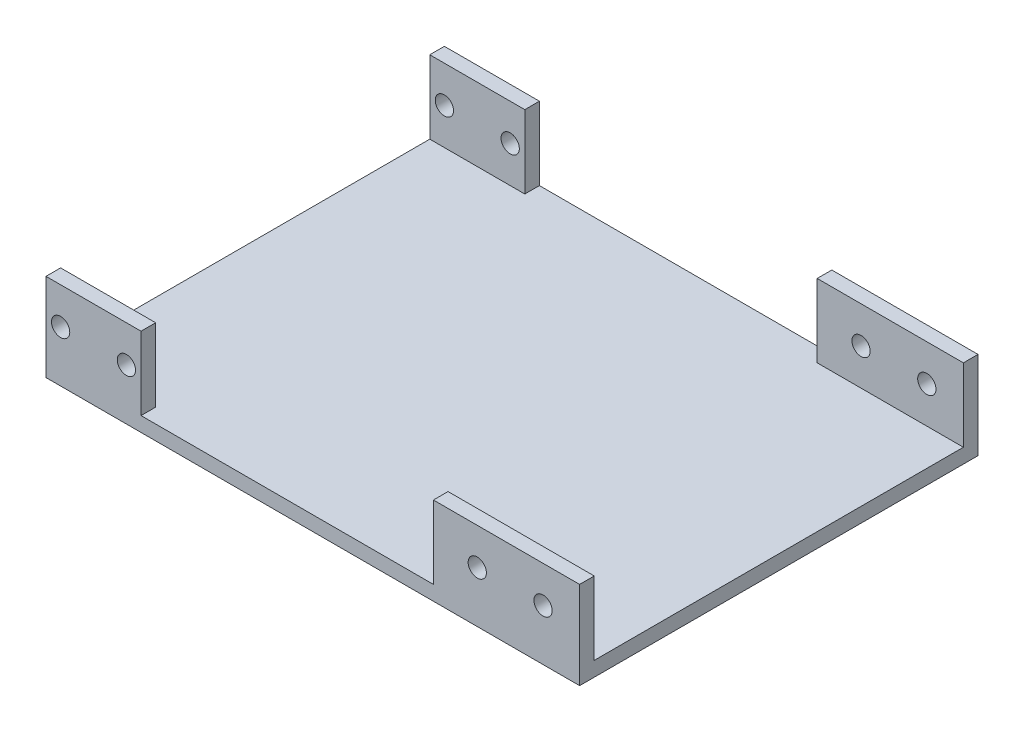
ISO-10303-21;
HEADER;
FILE_DESCRIPTION(('STEP AP214'),'2;1');
FILE_NAME('part.step','',(''),(''),'','','');
FILE_SCHEMA(('AUTOMOTIVE_DESIGN { 1 0 10303 214 1 1 1 1 }'));
ENDSEC;
DATA;
#1=APPLICATION_CONTEXT('core data for automotive mechanical design processes');
#2=APPLICATION_PROTOCOL_DEFINITION('international standard','automotive_design',2000,#1);
#3=PRODUCT_CONTEXT('',#1,'mechanical');
#4=PRODUCT('Part','Part','',(#3));
#5=PRODUCT_RELATED_PRODUCT_CATEGORY('part','',(#4));
#6=PRODUCT_DEFINITION_FORMATION('','',#4);
#7=PRODUCT_DEFINITION_CONTEXT('part definition',#1,'design');
#8=PRODUCT_DEFINITION('design','',#6,#7);
#9=PRODUCT_DEFINITION_SHAPE('','',#8);
#10=(LENGTH_UNIT() NAMED_UNIT(*) SI_UNIT(.MILLI.,.METRE.));
#11=(NAMED_UNIT(*) PLANE_ANGLE_UNIT() SI_UNIT($,.RADIAN.));
#12=(NAMED_UNIT(*) SI_UNIT($,.STERADIAN.) SOLID_ANGLE_UNIT());
#13=UNCERTAINTY_MEASURE_WITH_UNIT(LENGTH_MEASURE(1.E-05),#10,'distance_accuracy_value','');
#14=(GEOMETRIC_REPRESENTATION_CONTEXT(3) GLOBAL_UNCERTAINTY_ASSIGNED_CONTEXT((#13)) GLOBAL_UNIT_ASSIGNED_CONTEXT((#10,
#11,#12)) REPRESENTATION_CONTEXT('',''));
#15=CARTESIAN_POINT('',(0.,0.,0.));
#16=DIRECTION('',(0.,0.,1.));
#17=DIRECTION('',(1.,0.,0.));
#18=AXIS2_PLACEMENT_3D('',#15,#16,#17);
#19=CARTESIAN_POINT('',(0.,2.,0.));
#20=DIRECTION('',(0.,1.,0.));
#21=DIRECTION('',(0.,0.,1.));
#22=AXIS2_PLACEMENT_3D('',#19,#20,#21);
#23=PLANE('',#22);
#24=DIRECTION('',(-1.,0.,0.));
#25=VECTOR('',#24,1.);
#26=CARTESIAN_POINT('',(-51.9985494052508,2.,23.3059682035909));
#27=LINE('',#26,#25);
#28=CARTESIAN_POINT('',(-38.9985494052508,2.,23.3059682035909));
#29=VERTEX_POINT('',#28);
#30=CARTESIAN_POINT('',(-51.9985494052508,2.,23.3059682035909));
#31=VERTEX_POINT('',#30);
#32=EDGE_CURVE('E57',#29,#31,#27,.T.);
#33=ORIENTED_EDGE('',*,*,#32,.F.);
#34=DIRECTION('',(0.,0.,-1.));
#35=VECTOR('',#34,1.);
#36=CARTESIAN_POINT('',(-38.9985494052508,2.,23.3059682035909));
#37=LINE('',#36,#35);
#38=CARTESIAN_POINT('',(-38.9985494052508,2.,25.3059682035909));
#39=VERTEX_POINT('',#38);
#40=EDGE_CURVE('E179',#39,#29,#37,.T.);
#41=ORIENTED_EDGE('',*,*,#40,.F.);
#42=DIRECTION('',(1.,0.,0.));
#43=VECTOR('',#42,1.);
#44=CARTESIAN_POINT('',(-51.9985494052508,2.,25.3059682035909));
#45=LINE('',#44,#43);
#46=CARTESIAN_POINT('',(1.00145059474918,2.,25.3059682035909));
#47=VERTEX_POINT('',#46);
#48=EDGE_CURVE('E302',#39,#47,#45,.T.);
#49=ORIENTED_EDGE('',*,*,#48,.T.);
#50=DIRECTION('',(0.,0.,1.));
#51=VECTOR('',#50,1.);
#52=CARTESIAN_POINT('',(1.00145059474918,2.,23.3059682035909));
#53=LINE('',#52,#51);
#54=CARTESIAN_POINT('',(1.00145059474918,2.,23.3059682035909));
#55=VERTEX_POINT('',#54);
#56=EDGE_CURVE('E234',#55,#47,#53,.T.);
#57=ORIENTED_EDGE('',*,*,#56,.F.);
#58=DIRECTION('',(-1.,0.,0.));
#59=VECTOR('',#58,1.);
#60=CARTESIAN_POINT('',(1.00145059474918,2.,23.3059682035909));
#61=LINE('',#60,#59);
#62=CARTESIAN_POINT('',(21.0014505947492,2.,23.3059682035909));
#63=VERTEX_POINT('',#62);
#64=EDGE_CURVE('E240',#63,#55,#61,.T.);
#65=ORIENTED_EDGE('',*,*,#64,.F.);
#66=DIRECTION('',(0.,0.,-1.));
#67=VECTOR('',#66,1.);
#68=CARTESIAN_POINT('',(21.0014505947492,2.,-29.1940317964091));
#69=LINE('',#68,#67);
#70=CARTESIAN_POINT('',(21.0014505947492,2.,-27.1940317964091));
#71=VERTEX_POINT('',#70);
#72=EDGE_CURVE('E306',#63,#71,#69,.T.);
#73=ORIENTED_EDGE('',*,*,#72,.T.);
#74=DIRECTION('',(1.,0.,0.));
#75=VECTOR('',#74,1.);
#76=CARTESIAN_POINT('',(1.00145059474919,2.,-27.1940317964091));
#77=LINE('',#76,#75);
#78=CARTESIAN_POINT('',(1.00145059474919,2.,-27.1940317964091));
#79=VERTEX_POINT('',#78);
#80=EDGE_CURVE('E272',#79,#71,#77,.T.);
#81=ORIENTED_EDGE('',*,*,#80,.F.);
#82=DIRECTION('',(0.,0.,1.));
#83=VECTOR('',#82,1.);
#84=CARTESIAN_POINT('',(1.00145059474918,2.,-29.1940317964091));
#85=LINE('',#84,#83);
#86=CARTESIAN_POINT('',(1.00145059474918,2.,-29.1940317964091));
#87=VERTEX_POINT('',#86);
#88=EDGE_CURVE('E266',#87,#79,#85,.T.);
#89=ORIENTED_EDGE('',*,*,#88,.F.);
#90=DIRECTION('',(-1.,0.,0.));
#91=VECTOR('',#90,1.);
#92=CARTESIAN_POINT('',(-51.9985494052508,2.,-29.1940317964091));
#93=LINE('',#92,#91);
#94=CARTESIAN_POINT('',(-38.9985494052508,2.,-29.1940317964091));
#95=VERTEX_POINT('',#94);
#96=EDGE_CURVE('E309',#87,#95,#93,.T.);
#97=ORIENTED_EDGE('',*,*,#96,.T.);
#98=DIRECTION('',(0.,0.,-1.));
#99=VECTOR('',#98,1.);
#100=CARTESIAN_POINT('',(-38.9985494052508,2.,-29.1940317964091));
#101=LINE('',#100,#99);
#102=CARTESIAN_POINT('',(-38.9985494052508,2.,-27.1940317964091));
#103=VERTEX_POINT('',#102);
#104=EDGE_CURVE('E206',#103,#95,#101,.T.);
#105=ORIENTED_EDGE('',*,*,#104,.F.);
#106=DIRECTION('',(1.,0.,0.));
#107=VECTOR('',#106,1.);
#108=CARTESIAN_POINT('',(-51.9985494052508,2.,-27.1940317964091));
#109=LINE('',#108,#107);
#110=CARTESIAN_POINT('',(-51.9985494052508,2.,-27.1940317964091));
#111=VERTEX_POINT('',#110);
#112=EDGE_CURVE('E200',#111,#103,#109,.T.);
#113=ORIENTED_EDGE('',*,*,#112,.F.);
#114=DIRECTION('',(0.,0.,1.));
#115=VECTOR('',#114,1.);
#116=CARTESIAN_POINT('',(-51.9985494052508,2.,-29.1940317964091));
#117=LINE('',#116,#115);
#118=EDGE_CURVE('E62',#111,#31,#117,.T.);
#119=ORIENTED_EDGE('',*,*,#118,.T.);
#120=EDGE_LOOP('',(#33,#41,#49,#57,#65,#73,#81,#89,#97,#105,#113,#119));
#121=FACE_BOUND('',#120,.T.);
#122=ADVANCED_FACE('F39',(#121),#23,.T.);
#123=CARTESIAN_POINT('',(-51.9985494052508,2.,-29.1940317964091));
#124=DIRECTION('',(1.,0.,0.));
#125=DIRECTION('',(0.,0.,-1.));
#126=AXIS2_PLACEMENT_3D('',#123,#124,#125);
#127=PLANE('',#126);
#128=DIRECTION('',(0.,0.,1.));
#129=VECTOR('',#128,1.);
#130=CARTESIAN_POINT('',(-51.9985494052508,0.,-29.1940317964091));
#131=LINE('',#130,#129);
#132=CARTESIAN_POINT('',(-51.9985494052508,0.,-29.1940317964091));
#133=VERTEX_POINT('',#132);
#134=CARTESIAN_POINT('',(-51.9985494052508,0.,25.3059682035909));
#135=VERTEX_POINT('',#134);
#136=EDGE_CURVE('E160',#133,#135,#131,.T.);
#137=ORIENTED_EDGE('',*,*,#136,.T.);
#138=DIRECTION('',(0.,-1.,0.));
#139=VECTOR('',#138,1.);
#140=CARTESIAN_POINT('',(-51.9985494052508,2.,25.3059682035909));
#141=LINE('',#140,#139);
#142=CARTESIAN_POINT('',(-51.9985494052508,12.,25.3059682035909));
#143=VERTEX_POINT('',#142);
#144=EDGE_CURVE('E11',#143,#135,#141,.T.);
#145=ORIENTED_EDGE('',*,*,#144,.F.);
#146=DIRECTION('',(0.,0.,1.));
#147=VECTOR('',#146,1.);
#148=CARTESIAN_POINT('',(-51.9985494052508,12.,23.3059682035909));
#149=LINE('',#148,#147);
#150=CARTESIAN_POINT('',(-51.9985494052508,12.,23.3059682035909));
#151=VERTEX_POINT('',#150);
#152=EDGE_CURVE('E157',#151,#143,#149,.T.);
#153=ORIENTED_EDGE('',*,*,#152,.F.);
#154=DIRECTION('',(0.,-1.,0.));
#155=VECTOR('',#154,1.);
#156=CARTESIAN_POINT('',(-51.9985494052508,12.,23.3059682035909));
#157=LINE('',#156,#155);
#158=EDGE_CURVE('E189',#151,#31,#157,.T.);
#159=ORIENTED_EDGE('',*,*,#158,.T.);
#160=ORIENTED_EDGE('',*,*,#118,.F.);
#161=DIRECTION('',(0.,-1.,0.));
#162=VECTOR('',#161,1.);
#163=CARTESIAN_POINT('',(-51.9985494052508,12.,-27.1940317964091));
#164=LINE('',#163,#162);
#165=CARTESIAN_POINT('',(-51.9985494052508,12.,-27.1940317964091));
#166=VERTEX_POINT('',#165);
#167=EDGE_CURVE('E230',#166,#111,#164,.T.);
#168=ORIENTED_EDGE('',*,*,#167,.F.);
#169=DIRECTION('',(0.,0.,1.));
#170=VECTOR('',#169,1.);
#171=CARTESIAN_POINT('',(-51.9985494052508,12.,-29.1940317964091));
#172=LINE('',#171,#170);
#173=CARTESIAN_POINT('',(-51.9985494052508,12.,-29.1940317964091));
#174=VERTEX_POINT('',#173);
#175=EDGE_CURVE('E201',#174,#166,#172,.T.);
#176=ORIENTED_EDGE('',*,*,#175,.F.);
#177=DIRECTION('',(0.,-1.,0.));
#178=VECTOR('',#177,1.);
#179=CARTESIAN_POINT('',(-51.9985494052508,2.,-29.1940317964091));
#180=LINE('',#179,#178);
#181=EDGE_CURVE('E312',#174,#133,#180,.T.);
#182=ORIENTED_EDGE('',*,*,#181,.T.);
#183=EDGE_LOOP('',(#137,#145,#153,#159,#160,#168,#176,#182));
#184=FACE_BOUND('',#183,.T.);
#185=ADVANCED_FACE('F41',(#184),#127,.F.);
#186=CARTESIAN_POINT('',(-51.9985494052508,2.,25.3059682035909));
#187=DIRECTION('',(0.,0.,-1.));
#188=DIRECTION('',(-1.,0.,0.));
#189=AXIS2_PLACEMENT_3D('',#186,#187,#188);
#190=PLANE('',#189);
#191=CARTESIAN_POINT('',(16.0014505947492,7.,25.3059682035909));
#192=DIRECTION('',(0.,0.,1.));
#193=DIRECTION('',(1.,0.,0.));
#194=AXIS2_PLACEMENT_3D('',#191,#192,#193);
#195=CIRCLE('',#194,1.25);
#196=CARTESIAN_POINT('',(17.2514505947492,7.,25.3059682035909));
#197=VERTEX_POINT('',#196);
#198=EDGE_CURVE('E383',#197,#197,#195,.T.);
#199=ORIENTED_EDGE('',*,*,#198,.F.);
#200=EDGE_LOOP('',(#199));
#201=FACE_BOUND('',#200,.T.);
#202=CARTESIAN_POINT('',(7.00145059474918,7.,25.3059682035909));
#203=DIRECTION('',(0.,0.,1.));
#204=DIRECTION('',(1.,0.,0.));
#205=AXIS2_PLACEMENT_3D('',#202,#203,#204);
#206=CIRCLE('',#205,1.25);
#207=CARTESIAN_POINT('',(8.25145059474918,7.,25.3059682035909));
#208=VERTEX_POINT('',#207);
#209=EDGE_CURVE('E375',#208,#208,#206,.T.);
#210=ORIENTED_EDGE('',*,*,#209,.F.);
#211=EDGE_LOOP('',(#210));
#212=FACE_BOUND('',#211,.T.);
#213=CARTESIAN_POINT('',(-40.9985494052508,7.,25.3059682035909));
#214=DIRECTION('',(0.,0.,1.));
#215=DIRECTION('',(1.,0.,0.));
#216=AXIS2_PLACEMENT_3D('',#213,#214,#215);
#217=CIRCLE('',#216,1.25);
#218=CARTESIAN_POINT('',(-39.7485494052508,7.,25.3059682035909));
#219=VERTEX_POINT('',#218);
#220=EDGE_CURVE('E367',#219,#219,#217,.T.);
#221=ORIENTED_EDGE('',*,*,#220,.F.);
#222=EDGE_LOOP('',(#221));
#223=FACE_BOUND('',#222,.T.);
#224=CARTESIAN_POINT('',(-49.9985494052508,7.,25.3059682035909));
#225=DIRECTION('',(0.,0.,1.));
#226=DIRECTION('',(1.,0.,0.));
#227=AXIS2_PLACEMENT_3D('',#224,#225,#226);
#228=CIRCLE('',#227,1.25);
#229=CARTESIAN_POINT('',(-48.7485494052508,7.,25.3059682035909));
#230=VERTEX_POINT('',#229);
#231=EDGE_CURVE('E359',#230,#230,#228,.T.);
#232=ORIENTED_EDGE('',*,*,#231,.F.);
#233=EDGE_LOOP('',(#232));
#234=FACE_BOUND('',#233,.T.);
#235=DIRECTION('',(1.,0.,0.));
#236=VECTOR('',#235,1.);
#237=CARTESIAN_POINT('',(-51.9985494052508,0.,25.3059682035909));
#238=LINE('',#237,#236);
#239=CARTESIAN_POINT('',(21.0014505947492,0.,25.3059682035909));
#240=VERTEX_POINT('',#239);
#241=EDGE_CURVE('E315',#135,#240,#238,.T.);
#242=ORIENTED_EDGE('',*,*,#241,.T.);
#243=DIRECTION('',(0.,-1.,0.));
#244=VECTOR('',#243,1.);
#245=CARTESIAN_POINT('',(21.0014505947492,2.,25.3059682035909));
#246=LINE('',#245,#244);
#247=CARTESIAN_POINT('',(21.0014505947492,12.,25.3059682035909));
#248=VERTEX_POINT('',#247);
#249=EDGE_CURVE('E49',#248,#240,#246,.T.);
#250=ORIENTED_EDGE('',*,*,#249,.F.);
#251=DIRECTION('',(1.,0.,0.));
#252=VECTOR('',#251,1.);
#253=CARTESIAN_POINT('',(1.00145059474918,12.,25.3059682035909));
#254=LINE('',#253,#252);
#255=CARTESIAN_POINT('',(1.00145059474918,12.,25.3059682035909));
#256=VERTEX_POINT('',#255);
#257=EDGE_CURVE('E239',#256,#248,#254,.T.);
#258=ORIENTED_EDGE('',*,*,#257,.F.);
#259=DIRECTION('',(0.,-1.,0.));
#260=VECTOR('',#259,1.);
#261=CARTESIAN_POINT('',(1.00145059474918,12.,25.3059682035909));
#262=LINE('',#261,#260);
#263=EDGE_CURVE('E262',#256,#47,#262,.T.);
#264=ORIENTED_EDGE('',*,*,#263,.T.);
#265=ORIENTED_EDGE('',*,*,#48,.F.);
#266=DIRECTION('',(0.,-1.,0.));
#267=VECTOR('',#266,1.);
#268=CARTESIAN_POINT('',(-38.9985494052508,12.,25.3059682035909));
#269=LINE('',#268,#267);
#270=CARTESIAN_POINT('',(-38.9985494052508,12.,25.3059682035909));
#271=VERTEX_POINT('',#270);
#272=EDGE_CURVE('E166',#271,#39,#269,.T.);
#273=ORIENTED_EDGE('',*,*,#272,.F.);
#274=DIRECTION('',(1.,0.,0.));
#275=VECTOR('',#274,1.);
#276=CARTESIAN_POINT('',(-51.9985494052508,12.,25.3059682035909));
#277=LINE('',#276,#275);
#278=EDGE_CURVE('E163',#143,#271,#277,.T.);
#279=ORIENTED_EDGE('',*,*,#278,.F.);
#280=ORIENTED_EDGE('',*,*,#144,.T.);
#281=EDGE_LOOP('',(#242,#250,#258,#264,#265,#273,#279,#280));
#282=FACE_BOUND('',#281,.T.);
#283=ADVANCED_FACE('F164',(#201,#212,#223,#234,#282),#190,.F.);
#284=CARTESIAN_POINT('',(21.0014505947492,2.,-29.1940317964091));
#285=DIRECTION('',(-1.,0.,0.));
#286=DIRECTION('',(0.,0.,1.));
#287=AXIS2_PLACEMENT_3D('',#284,#285,#286);
#288=PLANE('',#287);
#289=DIRECTION('',(0.,0.,-1.));
#290=VECTOR('',#289,1.);
#291=CARTESIAN_POINT('',(21.0014505947492,0.,-29.1940317964091));
#292=LINE('',#291,#290);
#293=CARTESIAN_POINT('',(21.0014505947492,0.,-29.1940317964091));
#294=VERTEX_POINT('',#293);
#295=EDGE_CURVE('E318',#240,#294,#292,.T.);
#296=ORIENTED_EDGE('',*,*,#295,.T.);
#297=DIRECTION('',(0.,-1.,0.));
#298=VECTOR('',#297,1.);
#299=CARTESIAN_POINT('',(21.0014505947492,2.,-29.1940317964091));
#300=LINE('',#299,#298);
#301=CARTESIAN_POINT('',(21.0014505947492,12.,-29.1940317964091));
#302=VERTEX_POINT('',#301);
#303=EDGE_CURVE('E325',#302,#294,#300,.T.);
#304=ORIENTED_EDGE('',*,*,#303,.F.);
#305=DIRECTION('',(0.,0.,-1.));
#306=VECTOR('',#305,1.);
#307=CARTESIAN_POINT('',(21.0014505947492,12.,-29.1940317964091));
#308=LINE('',#307,#306);
#309=CARTESIAN_POINT('',(21.0014505947492,12.,-27.1940317964091));
#310=VERTEX_POINT('',#309);
#311=EDGE_CURVE('E275',#310,#302,#308,.T.);
#312=ORIENTED_EDGE('',*,*,#311,.F.);
#313=DIRECTION('',(0.,-1.,0.));
#314=VECTOR('',#313,1.);
#315=CARTESIAN_POINT('',(21.0014505947492,12.,-27.1940317964091));
#316=LINE('',#315,#314);
#317=EDGE_CURVE('E292',#310,#71,#316,.T.);
#318=ORIENTED_EDGE('',*,*,#317,.T.);
#319=ORIENTED_EDGE('',*,*,#72,.F.);
#320=DIRECTION('',(0.,-1.,0.));
#321=VECTOR('',#320,1.);
#322=CARTESIAN_POINT('',(21.0014505947492,12.,23.3059682035909));
#323=LINE('',#322,#321);
#324=CARTESIAN_POINT('',(21.0014505947492,12.,23.3059682035909));
#325=VERTEX_POINT('',#324);
#326=EDGE_CURVE('E259',#325,#63,#323,.T.);
#327=ORIENTED_EDGE('',*,*,#326,.F.);
#328=DIRECTION('',(0.,0.,-1.));
#329=VECTOR('',#328,1.);
#330=CARTESIAN_POINT('',(21.0014505947492,12.,23.3059682035909));
#331=LINE('',#330,#329);
#332=EDGE_CURVE('E244',#248,#325,#331,.T.);
#333=ORIENTED_EDGE('',*,*,#332,.F.);
#334=ORIENTED_EDGE('',*,*,#249,.T.);
#335=EDGE_LOOP('',(#296,#304,#312,#318,#319,#327,#333,#334));
#336=FACE_BOUND('',#335,.T.);
#337=ADVANCED_FACE('F436',(#336),#288,.F.);
#338=CARTESIAN_POINT('',(-51.9985494052508,2.,-29.1940317964091));
#339=DIRECTION('',(0.,0.,1.));
#340=DIRECTION('',(1.,0.,0.));
#341=AXIS2_PLACEMENT_3D('',#338,#339,#340);
#342=PLANE('',#341);
#343=CARTESIAN_POINT('',(16.0014505947492,7.,-29.1940317964091));
#344=DIRECTION('',(0.,0.,1.));
#345=DIRECTION('',(1.,0.,0.));
#346=AXIS2_PLACEMENT_3D('',#343,#344,#345);
#347=CIRCLE('',#346,1.25);
#348=CARTESIAN_POINT('',(17.2514505947492,7.,-29.1940317964091));
#349=VERTEX_POINT('',#348);
#350=EDGE_CURVE('E337',#349,#349,#347,.T.);
#351=ORIENTED_EDGE('',*,*,#350,.T.);
#352=EDGE_LOOP('',(#351));
#353=FACE_BOUND('',#352,.T.);
#354=CARTESIAN_POINT('',(7.00145059474918,7.,-29.1940317964091));
#355=DIRECTION('',(0.,0.,1.));
#356=DIRECTION('',(1.,0.,0.));
#357=AXIS2_PLACEMENT_3D('',#354,#355,#356);
#358=CIRCLE('',#357,1.25);
#359=CARTESIAN_POINT('',(8.25145059474918,7.,-29.1940317964091));
#360=VERTEX_POINT('',#359);
#361=EDGE_CURVE('E379',#360,#360,#358,.T.);
#362=ORIENTED_EDGE('',*,*,#361,.T.);
#363=EDGE_LOOP('',(#362));
#364=FACE_BOUND('',#363,.T.);
#365=CARTESIAN_POINT('',(-40.9985494052508,7.,-29.1940317964091));
#366=DIRECTION('',(0.,0.,1.));
#367=DIRECTION('',(1.,0.,0.));
#368=AXIS2_PLACEMENT_3D('',#365,#366,#367);
#369=CIRCLE('',#368,1.25);
#370=CARTESIAN_POINT('',(-39.7485494052508,7.,-29.1940317964091));
#371=VERTEX_POINT('',#370);
#372=EDGE_CURVE('E371',#371,#371,#369,.T.);
#373=ORIENTED_EDGE('',*,*,#372,.T.);
#374=EDGE_LOOP('',(#373));
#375=FACE_BOUND('',#374,.T.);
#376=CARTESIAN_POINT('',(-49.9985494052508,7.,-29.1940317964091));
#377=DIRECTION('',(0.,0.,1.));
#378=DIRECTION('',(1.,0.,0.));
#379=AXIS2_PLACEMENT_3D('',#376,#377,#378);
#380=CIRCLE('',#379,1.25);
#381=CARTESIAN_POINT('',(-48.7485494052508,7.,-29.1940317964091));
#382=VERTEX_POINT('',#381);
#383=EDGE_CURVE('E363',#382,#382,#380,.T.);
#384=ORIENTED_EDGE('',*,*,#383,.T.);
#385=EDGE_LOOP('',(#384));
#386=FACE_BOUND('',#385,.T.);
#387=DIRECTION('',(-1.,0.,0.));
#388=VECTOR('',#387,1.);
#389=CARTESIAN_POINT('',(-51.9985494052508,0.,-29.1940317964091));
#390=LINE('',#389,#388);
#391=EDGE_CURVE('E303',#294,#133,#390,.T.);
#392=ORIENTED_EDGE('',*,*,#391,.T.);
#393=ORIENTED_EDGE('',*,*,#181,.F.);
#394=DIRECTION('',(-1.,0.,0.));
#395=VECTOR('',#394,1.);
#396=CARTESIAN_POINT('',(-51.9985494052508,12.,-29.1940317964091));
#397=LINE('',#396,#395);
#398=CARTESIAN_POINT('',(-38.9985494052508,12.,-29.1940317964091));
#399=VERTEX_POINT('',#398);
#400=EDGE_CURVE('E212',#399,#174,#397,.T.);
#401=ORIENTED_EDGE('',*,*,#400,.F.);
#402=DIRECTION('',(0.,-1.,0.));
#403=VECTOR('',#402,1.);
#404=CARTESIAN_POINT('',(-38.9985494052508,12.,-29.1940317964091));
#405=LINE('',#404,#403);
#406=EDGE_CURVE('E216',#399,#95,#405,.T.);
#407=ORIENTED_EDGE('',*,*,#406,.T.);
#408=ORIENTED_EDGE('',*,*,#96,.F.);
#409=DIRECTION('',(0.,-1.,0.));
#410=VECTOR('',#409,1.);
#411=CARTESIAN_POINT('',(1.00145059474918,12.,-29.1940317964091));
#412=LINE('',#411,#410);
#413=CARTESIAN_POINT('',(1.00145059474918,12.,-29.1940317964091));
#414=VERTEX_POINT('',#413);
#415=EDGE_CURVE('E282',#414,#87,#412,.T.);
#416=ORIENTED_EDGE('',*,*,#415,.F.);
#417=DIRECTION('',(-1.,0.,0.));
#418=VECTOR('',#417,1.);
#419=CARTESIAN_POINT('',(1.00145059474918,12.,-29.1940317964091));
#420=LINE('',#419,#418);
#421=EDGE_CURVE('E279',#302,#414,#420,.T.);
#422=ORIENTED_EDGE('',*,*,#421,.F.);
#423=ORIENTED_EDGE('',*,*,#303,.T.);
#424=EDGE_LOOP('',(#392,#393,#401,#407,#408,#416,#422,#423));
#425=FACE_BOUND('',#424,.T.);
#426=ADVANCED_FACE('F391',(#353,#364,#375,#386,#425),#342,.F.);
#427=CARTESIAN_POINT('',(0.,0.,0.));
#428=DIRECTION('',(0.,1.,0.));
#429=DIRECTION('',(0.,0.,1.));
#430=AXIS2_PLACEMENT_3D('',#427,#428,#429);
#431=PLANE('',#430);
#432=ORIENTED_EDGE('',*,*,#136,.F.);
#433=ORIENTED_EDGE('',*,*,#391,.F.);
#434=ORIENTED_EDGE('',*,*,#295,.F.);
#435=ORIENTED_EDGE('',*,*,#241,.F.);
#436=EDGE_LOOP('',(#432,#433,#434,#435));
#437=FACE_BOUND('',#436,.T.);
#438=ADVANCED_FACE('F430',(#437),#431,.F.);
#439=CARTESIAN_POINT('',(1.00145059474918,12.,-29.1940317964091));
#440=DIRECTION('',(1.,0.,0.));
#441=DIRECTION('',(0.,0.,-1.));
#442=AXIS2_PLACEMENT_3D('',#439,#440,#441);
#443=PLANE('',#442);
#444=ORIENTED_EDGE('',*,*,#88,.T.);
#445=DIRECTION('',(0.,-1.,0.));
#446=VECTOR('',#445,1.);
#447=CARTESIAN_POINT('',(1.00145059474919,12.,-27.1940317964091));
#448=LINE('',#447,#446);
#449=CARTESIAN_POINT('',(1.00145059474919,12.,-27.1940317964091));
#450=VERTEX_POINT('',#449);
#451=EDGE_CURVE('E296',#450,#79,#448,.T.);
#452=ORIENTED_EDGE('',*,*,#451,.F.);
#453=DIRECTION('',(0.,0.,1.));
#454=VECTOR('',#453,1.);
#455=CARTESIAN_POINT('',(1.00145059474918,12.,-29.1940317964091));
#456=LINE('',#455,#454);
#457=EDGE_CURVE('E267',#414,#450,#456,.T.);
#458=ORIENTED_EDGE('',*,*,#457,.F.);
#459=ORIENTED_EDGE('',*,*,#415,.T.);
#460=EDGE_LOOP('',(#444,#452,#458,#459));
#461=FACE_BOUND('',#460,.T.);
#462=ADVANCED_FACE('F428',(#461),#443,.F.);
#463=CARTESIAN_POINT('',(1.00145059474919,12.,-27.1940317964091));
#464=DIRECTION('',(0.,0.,-1.));
#465=DIRECTION('',(-1.,0.,0.));
#466=AXIS2_PLACEMENT_3D('',#463,#464,#465);
#467=PLANE('',#466);
#468=CARTESIAN_POINT('',(16.0014505947492,7.,-27.1940317964091));
#469=DIRECTION('',(0.,0.,-1.));
#470=DIRECTION('',(-1.,0.,0.));
#471=AXIS2_PLACEMENT_3D('',#468,#469,#470);
#472=CIRCLE('',#471,1.25);
#473=CARTESIAN_POINT('',(14.7514505947492,7.,-27.1940317964091));
#474=VERTEX_POINT('',#473);
#475=EDGE_CURVE('E182',#474,#474,#472,.T.);
#476=ORIENTED_EDGE('',*,*,#475,.T.);
#477=EDGE_LOOP('',(#476));
#478=FACE_BOUND('',#477,.T.);
#479=CARTESIAN_POINT('',(7.00145059474918,7.,-27.1940317964091));
#480=DIRECTION('',(0.,0.,-1.));
#481=DIRECTION('',(-1.,0.,0.));
#482=AXIS2_PLACEMENT_3D('',#479,#480,#481);
#483=CIRCLE('',#482,1.25);
#484=CARTESIAN_POINT('',(5.75145059474918,7.,-27.1940317964091));
#485=VERTEX_POINT('',#484);
#486=EDGE_CURVE('E345',#485,#485,#483,.T.);
#487=ORIENTED_EDGE('',*,*,#486,.T.);
#488=EDGE_LOOP('',(#487));
#489=FACE_BOUND('',#488,.T.);
#490=ORIENTED_EDGE('',*,*,#80,.T.);
#491=ORIENTED_EDGE('',*,*,#317,.F.);
#492=DIRECTION('',(1.,0.,0.));
#493=VECTOR('',#492,1.);
#494=CARTESIAN_POINT('',(1.00145059474919,12.,-27.1940317964091));
#495=LINE('',#494,#493);
#496=EDGE_CURVE('E271',#450,#310,#495,.T.);
#497=ORIENTED_EDGE('',*,*,#496,.F.);
#498=ORIENTED_EDGE('',*,*,#451,.T.);
#499=EDGE_LOOP('',(#490,#491,#497,#498));
#500=FACE_BOUND('',#499,.T.);
#501=ADVANCED_FACE('F514',(#478,#489,#500),#467,.F.);
#502=CARTESIAN_POINT('',(0.,12.,0.));
#503=DIRECTION('',(0.,1.,0.));
#504=DIRECTION('',(0.,0.,1.));
#505=AXIS2_PLACEMENT_3D('',#502,#503,#504);
#506=PLANE('',#505);
#507=ORIENTED_EDGE('',*,*,#457,.T.);
#508=ORIENTED_EDGE('',*,*,#496,.T.);
#509=ORIENTED_EDGE('',*,*,#311,.T.);
#510=ORIENTED_EDGE('',*,*,#421,.T.);
#511=EDGE_LOOP('',(#507,#508,#509,#510));
#512=FACE_BOUND('',#511,.T.);
#513=ADVANCED_FACE('F512',(#512),#506,.T.);
#514=CARTESIAN_POINT('',(1.00145059474918,12.,23.3059682035909));
#515=DIRECTION('',(1.,0.,0.));
#516=DIRECTION('',(0.,0.,-1.));
#517=AXIS2_PLACEMENT_3D('',#514,#515,#516);
#518=PLANE('',#517);
#519=ORIENTED_EDGE('',*,*,#56,.T.);
#520=ORIENTED_EDGE('',*,*,#263,.F.);
#521=DIRECTION('',(0.,0.,1.));
#522=VECTOR('',#521,1.);
#523=CARTESIAN_POINT('',(1.00145059474918,12.,23.3059682035909));
#524=LINE('',#523,#522);
#525=CARTESIAN_POINT('',(1.00145059474918,12.,23.3059682035909));
#526=VERTEX_POINT('',#525);
#527=EDGE_CURVE('E235',#526,#256,#524,.T.);
#528=ORIENTED_EDGE('',*,*,#527,.F.);
#529=DIRECTION('',(0.,-1.,0.));
#530=VECTOR('',#529,1.);
#531=CARTESIAN_POINT('',(1.00145059474918,12.,23.3059682035909));
#532=LINE('',#531,#530);
#533=EDGE_CURVE('E250',#526,#55,#532,.T.);
#534=ORIENTED_EDGE('',*,*,#533,.T.);
#535=EDGE_LOOP('',(#519,#520,#528,#534));
#536=FACE_BOUND('',#535,.T.);
#537=ADVANCED_FACE('F489',(#536),#518,.F.);
#538=CARTESIAN_POINT('',(1.00145059474918,12.,23.3059682035909));
#539=DIRECTION('',(0.,0.,1.));
#540=DIRECTION('',(1.,0.,0.));
#541=AXIS2_PLACEMENT_3D('',#538,#539,#540);
#542=PLANE('',#541);
#543=CARTESIAN_POINT('',(16.0014505947492,7.,23.3059682035909));
#544=DIRECTION('',(0.,0.,1.));
#545=DIRECTION('',(1.,0.,0.));
#546=AXIS2_PLACEMENT_3D('',#543,#544,#545);
#547=CIRCLE('',#546,1.25);
#548=CARTESIAN_POINT('',(17.2514505947492,7.,23.3059682035909));
#549=VERTEX_POINT('',#548);
#550=EDGE_CURVE('E43',#549,#549,#547,.T.);
#551=ORIENTED_EDGE('',*,*,#550,.T.);
#552=EDGE_LOOP('',(#551));
#553=FACE_BOUND('',#552,.T.);
#554=CARTESIAN_POINT('',(7.00145059474918,7.,23.3059682035909));
#555=DIRECTION('',(0.,0.,1.));
#556=DIRECTION('',(1.,0.,0.));
#557=AXIS2_PLACEMENT_3D('',#554,#555,#556);
#558=CIRCLE('',#557,1.25);
#559=CARTESIAN_POINT('',(8.25145059474918,7.,23.3059682035909));
#560=VERTEX_POINT('',#559);
#561=EDGE_CURVE('E342',#560,#560,#558,.T.);
#562=ORIENTED_EDGE('',*,*,#561,.T.);
#563=EDGE_LOOP('',(#562));
#564=FACE_BOUND('',#563,.T.);
#565=ORIENTED_EDGE('',*,*,#64,.T.);
#566=ORIENTED_EDGE('',*,*,#533,.F.);
#567=DIRECTION('',(-1.,0.,0.));
#568=VECTOR('',#567,1.);
#569=CARTESIAN_POINT('',(1.00145059474918,12.,23.3059682035909));
#570=LINE('',#569,#568);
#571=EDGE_CURVE('E247',#325,#526,#570,.T.);
#572=ORIENTED_EDGE('',*,*,#571,.F.);
#573=ORIENTED_EDGE('',*,*,#326,.T.);
#574=EDGE_LOOP('',(#565,#566,#572,#573));
#575=FACE_BOUND('',#574,.T.);
#576=ADVANCED_FACE('F408',(#553,#564,#575),#542,.F.);
#577=CARTESIAN_POINT('',(0.,12.,0.));
#578=DIRECTION('',(0.,1.,0.));
#579=DIRECTION('',(0.,0.,1.));
#580=AXIS2_PLACEMENT_3D('',#577,#578,#579);
#581=PLANE('',#580);
#582=ORIENTED_EDGE('',*,*,#527,.T.);
#583=ORIENTED_EDGE('',*,*,#257,.T.);
#584=ORIENTED_EDGE('',*,*,#332,.T.);
#585=ORIENTED_EDGE('',*,*,#571,.T.);
#586=EDGE_LOOP('',(#582,#583,#584,#585));
#587=FACE_BOUND('',#586,.T.);
#588=ADVANCED_FACE('F483',(#587),#581,.T.);
#589=CARTESIAN_POINT('',(-51.9985494052508,12.,-27.1940317964091));
#590=DIRECTION('',(0.,0.,-1.));
#591=DIRECTION('',(-1.,0.,0.));
#592=AXIS2_PLACEMENT_3D('',#589,#590,#591);
#593=PLANE('',#592);
#594=CARTESIAN_POINT('',(-40.9985494052508,7.,-27.1940317964091));
#595=DIRECTION('',(0.,0.,-1.));
#596=DIRECTION('',(-1.,0.,0.));
#597=AXIS2_PLACEMENT_3D('',#594,#595,#596);
#598=CIRCLE('',#597,1.25);
#599=CARTESIAN_POINT('',(-42.2485494052508,7.,-27.1940317964091));
#600=VERTEX_POINT('',#599);
#601=EDGE_CURVE('E341',#600,#600,#598,.T.);
#602=ORIENTED_EDGE('',*,*,#601,.T.);
#603=EDGE_LOOP('',(#602));
#604=FACE_BOUND('',#603,.T.);
#605=CARTESIAN_POINT('',(-49.9985494052508,7.,-27.1940317964091));
#606=DIRECTION('',(0.,0.,-1.));
#607=DIRECTION('',(-1.,0.,0.));
#608=AXIS2_PLACEMENT_3D('',#605,#606,#607);
#609=CIRCLE('',#608,1.25);
#610=CARTESIAN_POINT('',(-51.2485494052508,7.,-27.1940317964091));
#611=VERTEX_POINT('',#610);
#612=EDGE_CURVE('E336',#611,#611,#609,.T.);
#613=ORIENTED_EDGE('',*,*,#612,.T.);
#614=EDGE_LOOP('',(#613));
#615=FACE_BOUND('',#614,.T.);
#616=ORIENTED_EDGE('',*,*,#112,.T.);
#617=DIRECTION('',(0.,-1.,0.));
#618=VECTOR('',#617,1.);
#619=CARTESIAN_POINT('',(-38.9985494052508,12.,-27.1940317964091));
#620=LINE('',#619,#618);
#621=CARTESIAN_POINT('',(-38.9985494052508,12.,-27.1940317964091));
#622=VERTEX_POINT('',#621);
#623=EDGE_CURVE('E226',#622,#103,#620,.T.);
#624=ORIENTED_EDGE('',*,*,#623,.F.);
#625=DIRECTION('',(1.,0.,0.));
#626=VECTOR('',#625,1.);
#627=CARTESIAN_POINT('',(-51.9985494052508,12.,-27.1940317964091));
#628=LINE('',#627,#626);
#629=EDGE_CURVE('E205',#166,#622,#628,.T.);
#630=ORIENTED_EDGE('',*,*,#629,.F.);
#631=ORIENTED_EDGE('',*,*,#167,.T.);
#632=EDGE_LOOP('',(#616,#624,#630,#631));
#633=FACE_BOUND('',#632,.T.);
#634=ADVANCED_FACE('F469',(#604,#615,#633),#593,.F.);
#635=CARTESIAN_POINT('',(-38.9985494052508,12.,-29.1940317964091));
#636=DIRECTION('',(-1.,0.,0.));
#637=DIRECTION('',(0.,0.,1.));
#638=AXIS2_PLACEMENT_3D('',#635,#636,#637);
#639=PLANE('',#638);
#640=ORIENTED_EDGE('',*,*,#104,.T.);
#641=ORIENTED_EDGE('',*,*,#406,.F.);
#642=DIRECTION('',(0.,0.,-1.));
#643=VECTOR('',#642,1.);
#644=CARTESIAN_POINT('',(-38.9985494052508,12.,-29.1940317964091));
#645=LINE('',#644,#643);
#646=EDGE_CURVE('E209',#622,#399,#645,.T.);
#647=ORIENTED_EDGE('',*,*,#646,.F.);
#648=ORIENTED_EDGE('',*,*,#623,.T.);
#649=EDGE_LOOP('',(#640,#641,#647,#648));
#650=FACE_BOUND('',#649,.T.);
#651=ADVANCED_FACE('F497',(#650),#639,.F.);
#652=CARTESIAN_POINT('',(0.,12.,0.));
#653=DIRECTION('',(0.,1.,0.));
#654=DIRECTION('',(0.,0.,1.));
#655=AXIS2_PLACEMENT_3D('',#652,#653,#654);
#656=PLANE('',#655);
#657=ORIENTED_EDGE('',*,*,#175,.T.);
#658=ORIENTED_EDGE('',*,*,#629,.T.);
#659=ORIENTED_EDGE('',*,*,#646,.T.);
#660=ORIENTED_EDGE('',*,*,#400,.T.);
#661=EDGE_LOOP('',(#657,#658,#659,#660));
#662=FACE_BOUND('',#661,.T.);
#663=ADVANCED_FACE('F473',(#662),#656,.T.);
#664=CARTESIAN_POINT('',(-38.9985494052508,12.,23.3059682035909));
#665=DIRECTION('',(-1.,0.,0.));
#666=DIRECTION('',(0.,0.,1.));
#667=AXIS2_PLACEMENT_3D('',#664,#665,#666);
#668=PLANE('',#667);
#669=ORIENTED_EDGE('',*,*,#40,.T.);
#670=DIRECTION('',(0.,-1.,0.));
#671=VECTOR('',#670,1.);
#672=CARTESIAN_POINT('',(-38.9985494052508,12.,23.3059682035909));
#673=LINE('',#672,#671);
#674=CARTESIAN_POINT('',(-38.9985494052508,12.,23.3059682035909));
#675=VERTEX_POINT('',#674);
#676=EDGE_CURVE('E194',#675,#29,#673,.T.);
#677=ORIENTED_EDGE('',*,*,#676,.F.);
#678=DIRECTION('',(0.,0.,-1.));
#679=VECTOR('',#678,1.);
#680=CARTESIAN_POINT('',(-38.9985494052508,12.,23.3059682035909));
#681=LINE('',#680,#679);
#682=EDGE_CURVE('E170',#271,#675,#681,.T.);
#683=ORIENTED_EDGE('',*,*,#682,.F.);
#684=ORIENTED_EDGE('',*,*,#272,.T.);
#685=EDGE_LOOP('',(#669,#677,#683,#684));
#686=FACE_BOUND('',#685,.T.);
#687=ADVANCED_FACE('F462',(#686),#668,.F.);
#688=CARTESIAN_POINT('',(-51.9985494052508,12.,23.3059682035909));
#689=DIRECTION('',(0.,0.,1.));
#690=DIRECTION('',(1.,0.,0.));
#691=AXIS2_PLACEMENT_3D('',#688,#689,#690);
#692=PLANE('',#691);
#693=CARTESIAN_POINT('',(-40.9985494052508,7.,23.3059682035909));
#694=DIRECTION('',(0.,0.,1.));
#695=DIRECTION('',(1.,0.,0.));
#696=AXIS2_PLACEMENT_3D('',#693,#694,#695);
#697=CIRCLE('',#696,1.25);
#698=CARTESIAN_POINT('',(-39.7485494052508,7.,23.3059682035909));
#699=VERTEX_POINT('',#698);
#700=EDGE_CURVE('E338',#699,#699,#697,.T.);
#701=ORIENTED_EDGE('',*,*,#700,.T.);
#702=EDGE_LOOP('',(#701));
#703=FACE_BOUND('',#702,.T.);
#704=CARTESIAN_POINT('',(-49.9985494052508,7.,23.3059682035909));
#705=DIRECTION('',(0.,0.,1.));
#706=DIRECTION('',(1.,0.,0.));
#707=AXIS2_PLACEMENT_3D('',#704,#705,#706);
#708=CIRCLE('',#707,1.25);
#709=CARTESIAN_POINT('',(-48.7485494052508,7.,23.3059682035909));
#710=VERTEX_POINT('',#709);
#711=EDGE_CURVE('E332',#710,#710,#708,.T.);
#712=ORIENTED_EDGE('',*,*,#711,.T.);
#713=EDGE_LOOP('',(#712));
#714=FACE_BOUND('',#713,.T.);
#715=ORIENTED_EDGE('',*,*,#32,.T.);
#716=ORIENTED_EDGE('',*,*,#158,.F.);
#717=DIRECTION('',(-1.,0.,0.));
#718=VECTOR('',#717,1.);
#719=CARTESIAN_POINT('',(-51.9985494052508,12.,23.3059682035909));
#720=LINE('',#719,#718);
#721=EDGE_CURVE('E174',#675,#151,#720,.T.);
#722=ORIENTED_EDGE('',*,*,#721,.F.);
#723=ORIENTED_EDGE('',*,*,#676,.T.);
#724=EDGE_LOOP('',(#715,#716,#722,#723));
#725=FACE_BOUND('',#724,.T.);
#726=ADVANCED_FACE('F459',(#703,#714,#725),#692,.F.);
#727=CARTESIAN_POINT('',(0.,12.,0.));
#728=DIRECTION('',(0.,1.,0.));
#729=DIRECTION('',(0.,0.,1.));
#730=AXIS2_PLACEMENT_3D('',#727,#728,#729);
#731=PLANE('',#730);
#732=ORIENTED_EDGE('',*,*,#152,.T.);
#733=ORIENTED_EDGE('',*,*,#278,.T.);
#734=ORIENTED_EDGE('',*,*,#682,.T.);
#735=ORIENTED_EDGE('',*,*,#721,.T.);
#736=EDGE_LOOP('',(#732,#733,#734,#735));
#737=FACE_BOUND('',#736,.T.);
#738=ADVANCED_FACE('F172',(#737),#731,.T.);
#739=CARTESIAN_POINT('',(-49.9985494052508,7.,-29.1940317964091));
#740=DIRECTION('',(0.,0.,1.));
#741=DIRECTION('',(1.,0.,0.));
#742=AXIS2_PLACEMENT_3D('',#739,#740,#741);
#743=CYLINDRICAL_SURFACE('',#742,1.25);
#744=ORIENTED_EDGE('',*,*,#231,.T.);
#745=EDGE_LOOP('',(#744));
#746=FACE_BOUND('',#745,.T.);
#747=ORIENTED_EDGE('',*,*,#711,.F.);
#748=EDGE_LOOP('',(#747));
#749=FACE_BOUND('',#748,.T.);
#750=ADVANCED_FACE('F451',(#746,#749),#743,.F.);
#751=CARTESIAN_POINT('',(-40.9985494052508,7.,-29.1940317964091));
#752=DIRECTION('',(0.,0.,1.));
#753=DIRECTION('',(1.,0.,0.));
#754=AXIS2_PLACEMENT_3D('',#751,#752,#753);
#755=CYLINDRICAL_SURFACE('',#754,1.25);
#756=ORIENTED_EDGE('',*,*,#220,.T.);
#757=EDGE_LOOP('',(#756));
#758=FACE_BOUND('',#757,.T.);
#759=ORIENTED_EDGE('',*,*,#700,.F.);
#760=EDGE_LOOP('',(#759));
#761=FACE_BOUND('',#760,.T.);
#762=ADVANCED_FACE('F454',(#758,#761),#755,.F.);
#763=ORIENTED_EDGE('',*,*,#383,.F.);
#764=EDGE_LOOP('',(#763));
#765=FACE_BOUND('',#764,.T.);
#766=ORIENTED_EDGE('',*,*,#612,.F.);
#767=EDGE_LOOP('',(#766));
#768=FACE_BOUND('',#767,.T.);
#769=ADVANCED_FACE('F456',(#765,#768),#743,.F.);
#770=ORIENTED_EDGE('',*,*,#372,.F.);
#771=EDGE_LOOP('',(#770));
#772=FACE_BOUND('',#771,.T.);
#773=ORIENTED_EDGE('',*,*,#601,.F.);
#774=EDGE_LOOP('',(#773));
#775=FACE_BOUND('',#774,.T.);
#776=ADVANCED_FACE('F419',(#772,#775),#755,.F.);
#777=CARTESIAN_POINT('',(7.00145059474918,7.,-29.1940317964091));
#778=DIRECTION('',(0.,0.,1.));
#779=DIRECTION('',(1.,0.,0.));
#780=AXIS2_PLACEMENT_3D('',#777,#778,#779);
#781=CYLINDRICAL_SURFACE('',#780,1.25);
#782=ORIENTED_EDGE('',*,*,#209,.T.);
#783=EDGE_LOOP('',(#782));
#784=FACE_BOUND('',#783,.T.);
#785=ORIENTED_EDGE('',*,*,#561,.F.);
#786=EDGE_LOOP('',(#785));
#787=FACE_BOUND('',#786,.T.);
#788=ADVANCED_FACE('F411',(#784,#787),#781,.F.);
#789=CARTESIAN_POINT('',(16.0014505947492,7.,-29.1940317964091));
#790=DIRECTION('',(0.,0.,1.));
#791=DIRECTION('',(1.,0.,0.));
#792=AXIS2_PLACEMENT_3D('',#789,#790,#791);
#793=CYLINDRICAL_SURFACE('',#792,1.25);
#794=ORIENTED_EDGE('',*,*,#198,.T.);
#795=EDGE_LOOP('',(#794));
#796=FACE_BOUND('',#795,.T.);
#797=ORIENTED_EDGE('',*,*,#550,.F.);
#798=EDGE_LOOP('',(#797));
#799=FACE_BOUND('',#798,.T.);
#800=ADVANCED_FACE('F399',(#796,#799),#793,.F.);
#801=ORIENTED_EDGE('',*,*,#361,.F.);
#802=EDGE_LOOP('',(#801));
#803=FACE_BOUND('',#802,.T.);
#804=ORIENTED_EDGE('',*,*,#486,.F.);
#805=EDGE_LOOP('',(#804));
#806=FACE_BOUND('',#805,.T.);
#807=ADVANCED_FACE('F397',(#803,#806),#781,.F.);
#808=ORIENTED_EDGE('',*,*,#350,.F.);
#809=EDGE_LOOP('',(#808));
#810=FACE_BOUND('',#809,.T.);
#811=ORIENTED_EDGE('',*,*,#475,.F.);
#812=EDGE_LOOP('',(#811));
#813=FACE_BOUND('',#812,.T.);
#814=ADVANCED_FACE('F394',(#810,#813),#793,.F.);
#815=CLOSED_SHELL('',(#122,#185,#283,#337,#426,#438,#462,#501,#513,#537,#576,#588,#634,#651,
#663,#687,#726,#738,#750,#762,#769,#776,#788,#800,#807,#814));
#816=MANIFOLD_SOLID_BREP('B2',#815);
#817=ADVANCED_BREP_SHAPE_REPRESENTATION('',(#18,#816),#14);
#818=SHAPE_DEFINITION_REPRESENTATION(#9,#817);
ENDSEC;
END-ISO-10303-21;
